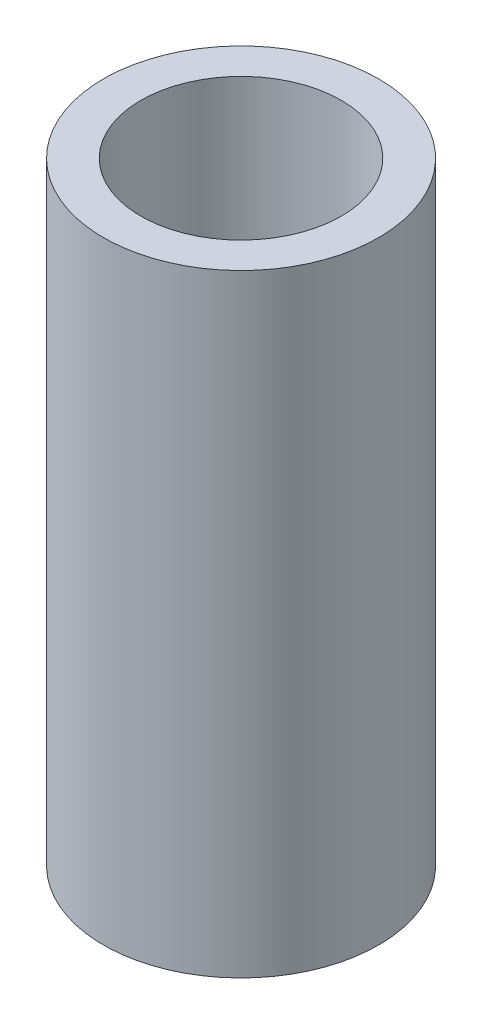
ISO-10303-21;
HEADER;
FILE_DESCRIPTION(('STEP AP214'),'2;1');
FILE_NAME('part.step','',(''),(''),'','','');
FILE_SCHEMA(('AUTOMOTIVE_DESIGN { 1 0 10303 214 1 1 1 1 }'));
ENDSEC;
DATA;
#1=APPLICATION_CONTEXT('core data for automotive mechanical design processes');
#2=APPLICATION_PROTOCOL_DEFINITION('international standard','automotive_design',2000,#1);
#3=PRODUCT_CONTEXT('',#1,'mechanical');
#4=PRODUCT('Part','Part','',(#3));
#5=PRODUCT_RELATED_PRODUCT_CATEGORY('part','',(#4));
#6=PRODUCT_DEFINITION_FORMATION('','',#4);
#7=PRODUCT_DEFINITION_CONTEXT('part definition',#1,'design');
#8=PRODUCT_DEFINITION('design','',#6,#7);
#9=PRODUCT_DEFINITION_SHAPE('','',#8);
#10=(LENGTH_UNIT() NAMED_UNIT(*) SI_UNIT(.MILLI.,.METRE.));
#11=(NAMED_UNIT(*) PLANE_ANGLE_UNIT() SI_UNIT($,.RADIAN.));
#12=(NAMED_UNIT(*) SI_UNIT($,.STERADIAN.) SOLID_ANGLE_UNIT());
#13=UNCERTAINTY_MEASURE_WITH_UNIT(LENGTH_MEASURE(1.E-05),#10,'distance_accuracy_value','');
#14=(GEOMETRIC_REPRESENTATION_CONTEXT(3) GLOBAL_UNCERTAINTY_ASSIGNED_CONTEXT((#13)) GLOBAL_UNIT_ASSIGNED_CONTEXT((#10,
#11,#12)) REPRESENTATION_CONTEXT('',''));
#15=CARTESIAN_POINT('',(0.,0.,0.));
#16=DIRECTION('',(0.,0.,1.));
#17=DIRECTION('',(1.,0.,0.));
#18=AXIS2_PLACEMENT_3D('',#15,#16,#17);
#19=CARTESIAN_POINT('',(0.,111.352511532043,0.));
#20=DIRECTION('',(0.,-1.,0.));
#21=DIRECTION('',(0.,0.,-1.));
#22=AXIS2_PLACEMENT_3D('',#19,#20,#21);
#23=CYLINDRICAL_SURFACE('',#22,25.);
#24=CARTESIAN_POINT('',(0.,111.352511532043,0.));
#25=DIRECTION('',(0.,1.,0.));
#26=DIRECTION('',(0.,0.,1.));
#27=AXIS2_PLACEMENT_3D('',#24,#25,#26);
#28=CIRCLE('',#27,25.);
#29=CARTESIAN_POINT('',(0.,111.352511532043,-25.));
#30=VERTEX_POINT('',#29);
#31=EDGE_CURVE('E10',#30,#30,#28,.T.);
#32=CARTESIAN_POINT('',(0.,0.,0.));
#33=DIRECTION('',(0.,1.,0.));
#34=DIRECTION('',(0.,0.,1.));
#35=AXIS2_PLACEMENT_3D('',#32,#33,#34);
#36=CIRCLE('',#35,25.);
#37=CARTESIAN_POINT('',(0.,0.,-25.));
#38=VERTEX_POINT('',#37);
#39=EDGE_CURVE('E37',#38,#38,#36,.T.);
#40=CARTESIAN_POINT('',(0.,111.352511532043,-25.));
#41=CARTESIAN_POINT('',(0.,110.192589536918,-25.));
#42=CARTESIAN_POINT('',(0.,109.032667541792,-25.));
#43=CARTESIAN_POINT('',(0.,106.712823551541,-25.));
#44=CARTESIAN_POINT('',(0.,105.552901556416,-25.));
#45=CARTESIAN_POINT('',(0.,103.233057566165,-25.));
#46=CARTESIAN_POINT('',(0.,102.07313557104,-25.));
#47=CARTESIAN_POINT('',(0.,99.7532915807887,-25.));
#48=CARTESIAN_POINT('',(0.,98.5933695856632,-25.));
#49=CARTESIAN_POINT('',(0.,96.2735255954123,-25.));
#50=CARTESIAN_POINT('',(0.,95.1136036002869,-25.));
#51=CARTESIAN_POINT('',(0.,92.793759610036,-25.));
#52=CARTESIAN_POINT('',(0.,91.6338376149105,-25.));
#53=CARTESIAN_POINT('',(0.,89.3139936246596,-25.));
#54=CARTESIAN_POINT('',(0.,88.1540716295342,-25.));
#55=CARTESIAN_POINT('',(0.,85.8342276392833,-25.));
#56=CARTESIAN_POINT('',(0.,84.6743056441578,-25.));
#57=CARTESIAN_POINT('',(0.,82.354461653907,-25.));
#58=CARTESIAN_POINT('',(0.,81.1945396587815,-25.));
#59=CARTESIAN_POINT('',(0.,78.8746956685306,-25.));
#60=CARTESIAN_POINT('',(0.,77.7147736734051,-25.));
#61=CARTESIAN_POINT('',(0.,75.3949296831542,-25.));
#62=CARTESIAN_POINT('',(0.,74.2350076880288,-25.));
#63=CARTESIAN_POINT('',(0.,71.9151636977779,-25.));
#64=CARTESIAN_POINT('',(0.,70.7552417026524,-25.));
#65=CARTESIAN_POINT('',(0.,68.4353977124016,-25.));
#66=CARTESIAN_POINT('',(0.,67.2754757172761,-25.));
#67=CARTESIAN_POINT('',(0.,64.9556317270252,-25.));
#68=CARTESIAN_POINT('',(0.,63.7957097318997,-25.));
#69=CARTESIAN_POINT('',(0.,61.4758657416488,-25.));
#70=CARTESIAN_POINT('',(0.,60.3159437465234,-25.));
#71=CARTESIAN_POINT('',(0.,57.9960997562725,-25.));
#72=CARTESIAN_POINT('',(0.,56.836177761147,-25.));
#73=CARTESIAN_POINT('',(0.,54.5163337708961,-25.));
#74=CARTESIAN_POINT('',(0.,53.3564117757707,-25.));
#75=CARTESIAN_POINT('',(0.,51.0365677855198,-25.));
#76=CARTESIAN_POINT('',(0.,49.8766457903943,-25.));
#77=CARTESIAN_POINT('',(0.,47.5568018001434,-25.));
#78=CARTESIAN_POINT('',(0.,46.396879805018,-25.));
#79=CARTESIAN_POINT('',(0.,44.0770358147671,-25.));
#80=CARTESIAN_POINT('',(0.,42.9171138196416,-25.));
#81=CARTESIAN_POINT('',(0.,40.5972698293907,-25.));
#82=CARTESIAN_POINT('',(0.,39.4373478342653,-25.));
#83=CARTESIAN_POINT('',(0.,37.1175038440144,-25.));
#84=CARTESIAN_POINT('',(0.,35.9575818488889,-25.));
#85=CARTESIAN_POINT('',(0.,33.637737858638,-25.));
#86=CARTESIAN_POINT('',(0.,32.4778158635126,-25.));
#87=CARTESIAN_POINT('',(0.,30.1579718732617,-25.));
#88=CARTESIAN_POINT('',(0.,28.9980498781362,-25.));
#89=CARTESIAN_POINT('',(0.,26.6782058878853,-25.));
#90=CARTESIAN_POINT('',(0.,25.5182838927599,-25.));
#91=CARTESIAN_POINT('',(0.,23.198439902509,-25.));
#92=CARTESIAN_POINT('',(0.,22.0385179073835,-25.));
#93=CARTESIAN_POINT('',(0.,19.7186739171326,-25.));
#94=CARTESIAN_POINT('',(0.,18.5587519220072,-25.));
#95=CARTESIAN_POINT('',(0.,16.2389079317563,-25.));
#96=CARTESIAN_POINT('',(0.,15.0789859366308,-25.));
#97=CARTESIAN_POINT('',(0.,12.7591419463799,-25.));
#98=CARTESIAN_POINT('',(0.,11.5992199512545,-25.));
#99=CARTESIAN_POINT('',(0.,9.27937596100359,-25.));
#100=CARTESIAN_POINT('',(0.,8.11945396587814,-25.));
#101=CARTESIAN_POINT('',(0.,5.79960997562724,-25.));
#102=CARTESIAN_POINT('',(0.,4.63968798050178,-25.));
#103=CARTESIAN_POINT('',(0.,2.31984399025088,-25.));
#104=CARTESIAN_POINT('',(0.,1.15992199512544,-25.));
#105=CARTESIAN_POINT('',(0.,0.,-25.));
#106=B_SPLINE_CURVE_WITH_KNOTS('',3,(#40,#41,#42,#43,#44,#45,#46,#47,#48,#49,#50,#51,#52,#53,
#54,#55,#56,#57,#58,#59,#60,#61,#62,#63,#64,#65,#66,#67,#68,#69,#70,#71,#72,#73,#74,#75,#76,#77,
#78,#79,#80,#81,#82,#83,#84,#85,#86,#87,#88,#89,#90,#91,#92,#93,#94,#95,#96,#97,#98,#99,#100,
#101,#102,#103,#104,#105),.UNSPECIFIED.,.F.,.F.,(4,2,2,2,2,2,2,2,2,2,2,2,2,2,2,2,2,2,2,2,2,2,2,
2,2,2,2,2,2,2,2,2,4),(0.,3.47976598537635,6.95953197075269,10.439297956129,13.9190639415054,
17.3988299268817,20.8785959122581,24.3583618976344,27.8381278830108,31.3178938683871,
34.7976598537635,38.2774258391398,41.7571918245162,45.2369578098926,48.7167237952689,
52.1964897806452,55.6762557660216,59.1560217513979,62.6357877367743,66.1155537221507,
69.595319707527,73.0750856929033,76.5548516782797,80.0346176636561,83.5143836490324,
86.9941496344088,90.4739156197851,93.9536816051614,97.4334475905378,100.913213575914,
104.392979561291,107.872745546667,111.352511532043),.UNSPECIFIED.);
#107=EDGE_CURVE('BSEAM40',#30,#38,#106,.T.);
#108=ORIENTED_EDGE('',*,*,#31,.F.);
#109=ORIENTED_EDGE('',*,*,#39,.T.);
#110=ORIENTED_EDGE('',*,*,#107,.T.);
#111=ORIENTED_EDGE('',*,*,#107,.F.);
#112=EDGE_LOOP('',(#108,#110,#109,#111));
#113=FACE_BOUND('',#112,.T.);
#114=ADVANCED_FACE('F40',(#113),#23,.T.);
#115=CARTESIAN_POINT('',(0.,111.352511532043,0.));
#116=DIRECTION('',(0.,1.,0.));
#117=DIRECTION('',(0.,0.,1.));
#118=AXIS2_PLACEMENT_3D('',#115,#116,#117);
#119=PLANE('',#118);
#120=CARTESIAN_POINT('',(0.,111.352511532043,0.));
#121=DIRECTION('',(0.,1.,0.));
#122=DIRECTION('',(0.,0.,1.));
#123=AXIS2_PLACEMENT_3D('',#120,#121,#122);
#124=CIRCLE('',#123,18.2282672102102);
#125=CARTESIAN_POINT('',(0.,111.352511532043,-18.2282672102102));
#126=VERTEX_POINT('',#125);
#127=EDGE_CURVE('E50',#126,#126,#124,.T.);
#128=ORIENTED_EDGE('',*,*,#127,.F.);
#129=EDGE_LOOP('',(#128));
#130=FACE_BOUND('',#129,.T.);
#131=ORIENTED_EDGE('',*,*,#31,.T.);
#132=EDGE_LOOP('',(#131));
#133=FACE_BOUND('',#132,.T.);
#134=ADVANCED_FACE('F59',(#130,#133),#119,.T.);
#135=CARTESIAN_POINT('',(0.,0.,0.));
#136=DIRECTION('',(0.,1.,0.));
#137=DIRECTION('',(0.,0.,1.));
#138=AXIS2_PLACEMENT_3D('',#135,#136,#137);
#139=PLANE('',#138);
#140=CARTESIAN_POINT('',(0.,0.,0.));
#141=DIRECTION('',(0.,1.,0.));
#142=DIRECTION('',(0.,0.,1.));
#143=AXIS2_PLACEMENT_3D('',#140,#141,#142);
#144=CIRCLE('',#143,18.2282672102102);
#145=CARTESIAN_POINT('',(0.,0.,-18.2282672102102));
#146=VERTEX_POINT('',#145);
#147=EDGE_CURVE('E47',#146,#146,#144,.T.);
#148=ORIENTED_EDGE('',*,*,#147,.T.);
#149=EDGE_LOOP('',(#148));
#150=FACE_BOUND('',#149,.T.);
#151=ORIENTED_EDGE('',*,*,#39,.F.);
#152=EDGE_LOOP('',(#151));
#153=FACE_BOUND('',#152,.T.);
#154=ADVANCED_FACE('F58',(#150,#153),#139,.F.);
#155=CARTESIAN_POINT('',(0.,111.352511532043,0.));
#156=DIRECTION('',(0.,-1.,0.));
#157=DIRECTION('',(0.,0.,-1.));
#158=AXIS2_PLACEMENT_3D('',#155,#156,#157);
#159=CYLINDRICAL_SURFACE('',#158,18.2282672102102);
#160=CARTESIAN_POINT('',(0.,111.352511532043,-18.2282672102102));
#161=CARTESIAN_POINT('',(0.,110.192589536918,-18.2282672102102));
#162=CARTESIAN_POINT('',(0.,109.032667541792,-18.2282672102102));
#163=CARTESIAN_POINT('',(0.,106.712823551541,-18.2282672102102));
#164=CARTESIAN_POINT('',(0.,105.552901556416,-18.2282672102102));
#165=CARTESIAN_POINT('',(0.,103.233057566165,-18.2282672102102));
#166=CARTESIAN_POINT('',(0.,102.07313557104,-18.2282672102102));
#167=CARTESIAN_POINT('',(0.,99.7532915807887,-18.2282672102102));
#168=CARTESIAN_POINT('',(0.,98.5933695856632,-18.2282672102102));
#169=CARTESIAN_POINT('',(0.,96.2735255954123,-18.2282672102102));
#170=CARTESIAN_POINT('',(0.,95.1136036002869,-18.2282672102102));
#171=CARTESIAN_POINT('',(0.,92.793759610036,-18.2282672102102));
#172=CARTESIAN_POINT('',(0.,91.6338376149105,-18.2282672102102));
#173=CARTESIAN_POINT('',(0.,89.3139936246596,-18.2282672102102));
#174=CARTESIAN_POINT('',(0.,88.1540716295342,-18.2282672102102));
#175=CARTESIAN_POINT('',(0.,85.8342276392833,-18.2282672102102));
#176=CARTESIAN_POINT('',(0.,84.6743056441578,-18.2282672102102));
#177=CARTESIAN_POINT('',(0.,82.354461653907,-18.2282672102102));
#178=CARTESIAN_POINT('',(0.,81.1945396587815,-18.2282672102102));
#179=CARTESIAN_POINT('',(0.,78.8746956685306,-18.2282672102102));
#180=CARTESIAN_POINT('',(0.,77.7147736734051,-18.2282672102102));
#181=CARTESIAN_POINT('',(0.,75.3949296831542,-18.2282672102102));
#182=CARTESIAN_POINT('',(0.,74.2350076880288,-18.2282672102102));
#183=CARTESIAN_POINT('',(0.,71.9151636977779,-18.2282672102102));
#184=CARTESIAN_POINT('',(0.,70.7552417026524,-18.2282672102102));
#185=CARTESIAN_POINT('',(0.,68.4353977124016,-18.2282672102102));
#186=CARTESIAN_POINT('',(0.,67.2754757172761,-18.2282672102102));
#187=CARTESIAN_POINT('',(0.,64.9556317270252,-18.2282672102102));
#188=CARTESIAN_POINT('',(0.,63.7957097318997,-18.2282672102102));
#189=CARTESIAN_POINT('',(0.,61.4758657416488,-18.2282672102102));
#190=CARTESIAN_POINT('',(0.,60.3159437465234,-18.2282672102102));
#191=CARTESIAN_POINT('',(0.,57.9960997562725,-18.2282672102102));
#192=CARTESIAN_POINT('',(0.,56.836177761147,-18.2282672102102));
#193=CARTESIAN_POINT('',(0.,54.5163337708961,-18.2282672102102));
#194=CARTESIAN_POINT('',(0.,53.3564117757707,-18.2282672102102));
#195=CARTESIAN_POINT('',(0.,51.0365677855198,-18.2282672102102));
#196=CARTESIAN_POINT('',(0.,49.8766457903943,-18.2282672102102));
#197=CARTESIAN_POINT('',(0.,47.5568018001434,-18.2282672102102));
#198=CARTESIAN_POINT('',(0.,46.396879805018,-18.2282672102102));
#199=CARTESIAN_POINT('',(0.,44.0770358147671,-18.2282672102102));
#200=CARTESIAN_POINT('',(0.,42.9171138196416,-18.2282672102102));
#201=CARTESIAN_POINT('',(0.,40.5972698293907,-18.2282672102102));
#202=CARTESIAN_POINT('',(0.,39.4373478342653,-18.2282672102102));
#203=CARTESIAN_POINT('',(0.,37.1175038440144,-18.2282672102102));
#204=CARTESIAN_POINT('',(0.,35.9575818488889,-18.2282672102102));
#205=CARTESIAN_POINT('',(0.,33.637737858638,-18.2282672102102));
#206=CARTESIAN_POINT('',(0.,32.4778158635126,-18.2282672102102));
#207=CARTESIAN_POINT('',(0.,30.1579718732617,-18.2282672102102));
#208=CARTESIAN_POINT('',(0.,28.9980498781362,-18.2282672102102));
#209=CARTESIAN_POINT('',(0.,26.6782058878853,-18.2282672102102));
#210=CARTESIAN_POINT('',(0.,25.5182838927599,-18.2282672102102));
#211=CARTESIAN_POINT('',(0.,23.198439902509,-18.2282672102102));
#212=CARTESIAN_POINT('',(0.,22.0385179073835,-18.2282672102102));
#213=CARTESIAN_POINT('',(0.,19.7186739171326,-18.2282672102102));
#214=CARTESIAN_POINT('',(0.,18.5587519220072,-18.2282672102102));
#215=CARTESIAN_POINT('',(0.,16.2389079317563,-18.2282672102102));
#216=CARTESIAN_POINT('',(0.,15.0789859366308,-18.2282672102102));
#217=CARTESIAN_POINT('',(0.,12.7591419463799,-18.2282672102102));
#218=CARTESIAN_POINT('',(0.,11.5992199512545,-18.2282672102102));
#219=CARTESIAN_POINT('',(0.,9.27937596100359,-18.2282672102102));
#220=CARTESIAN_POINT('',(0.,8.11945396587814,-18.2282672102102));
#221=CARTESIAN_POINT('',(0.,5.79960997562724,-18.2282672102102));
#222=CARTESIAN_POINT('',(0.,4.63968798050178,-18.2282672102102));
#223=CARTESIAN_POINT('',(0.,2.31984399025088,-18.2282672102102));
#224=CARTESIAN_POINT('',(0.,1.15992199512544,-18.2282672102102));
#225=CARTESIAN_POINT('',(0.,0.,-18.2282672102102));
#226=B_SPLINE_CURVE_WITH_KNOTS('',3,(#160,#161,#162,#163,#164,#165,#166,#167,#168,#169,#170,
#171,#172,#173,#174,#175,#176,#177,#178,#179,#180,#181,#182,#183,#184,#185,#186,#187,#188,#189,
#190,#191,#192,#193,#194,#195,#196,#197,#198,#199,#200,#201,#202,#203,#204,#205,#206,#207,#208,
#209,#210,#211,#212,#213,#214,#215,#216,#217,#218,#219,#220,#221,#222,#223,#224,#225),
.UNSPECIFIED.,.F.,.F.,(4,2,2,2,2,2,2,2,2,2,2,2,2,2,2,2,2,2,2,2,2,2,2,2,2,2,2,2,2,2,2,2,4),(0.,
3.47976598537636,6.95953197075271,10.4392979561291,13.9190639415054,17.3988299268818,
20.8785959122581,24.3583618976345,27.8381278830108,31.3178938683872,34.7976598537635,
38.2774258391399,41.7571918245162,45.2369578098926,48.7167237952689,52.1964897806453,
55.6762557660216,59.156021751398,62.6357877367743,66.1155537221507,69.595319707527,
73.0750856929034,76.5548516782797,80.0346176636561,83.5143836490324,86.9941496344088,
90.4739156197851,93.9536816051615,97.4334475905378,100.913213575914,104.392979561291,
107.872745546667,111.352511532043),.UNSPECIFIED.);
#227=EDGE_CURVE('BSEAM54',#126,#146,#226,.T.);
#228=ORIENTED_EDGE('',*,*,#127,.T.);
#229=ORIENTED_EDGE('',*,*,#147,.F.);
#230=ORIENTED_EDGE('',*,*,#227,.T.);
#231=ORIENTED_EDGE('',*,*,#227,.F.);
#232=EDGE_LOOP('',(#228,#230,#229,#231));
#233=FACE_BOUND('',#232,.T.);
#234=ADVANCED_FACE('F54',(#233),#159,.F.);
#235=CLOSED_SHELL('',(#114,#134,#154,#234));
#236=MANIFOLD_SOLID_BREP('B2',#235);
#237=ADVANCED_BREP_SHAPE_REPRESENTATION('',(#18,#236),#14);
#238=SHAPE_DEFINITION_REPRESENTATION(#9,#237);
ENDSEC;
END-ISO-10303-21;
